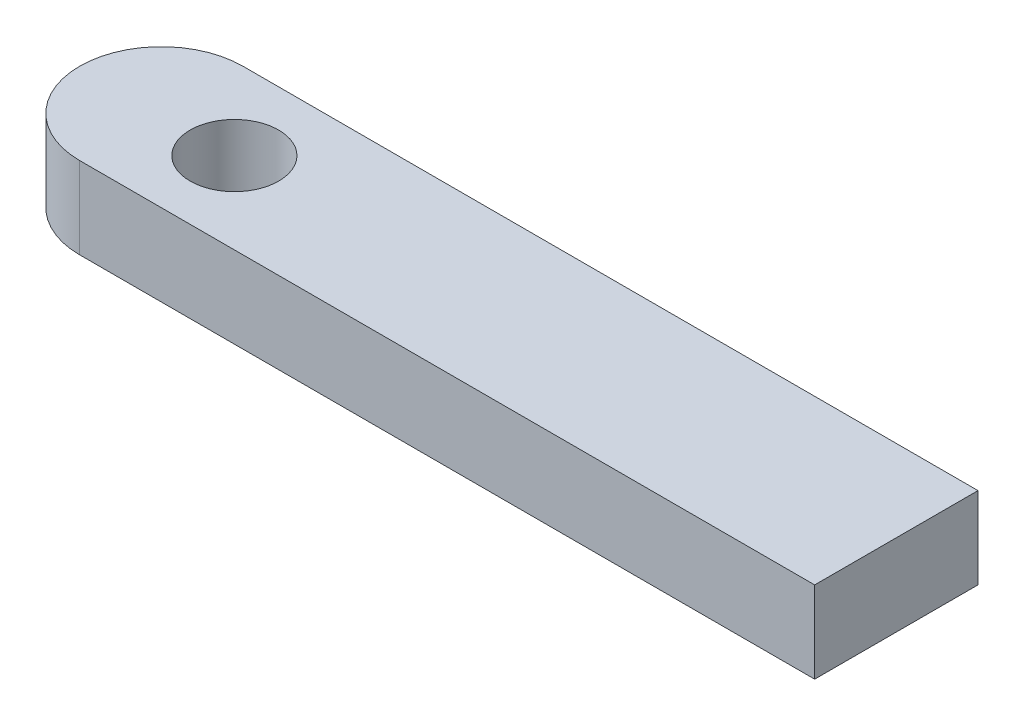
ISO-10303-21;
HEADER;
FILE_DESCRIPTION(('STEP AP214'),'2;1');
FILE_NAME('part.step','',(''),(''),'','','');
FILE_SCHEMA(('AUTOMOTIVE_DESIGN { 1 0 10303 214 1 1 1 1 }'));
ENDSEC;
DATA;
#1=APPLICATION_CONTEXT('core data for automotive mechanical design processes');
#2=APPLICATION_PROTOCOL_DEFINITION('international standard','automotive_design',2000,#1);
#3=PRODUCT_CONTEXT('',#1,'mechanical');
#4=PRODUCT('Part','Part','',(#3));
#5=PRODUCT_RELATED_PRODUCT_CATEGORY('part','',(#4));
#6=PRODUCT_DEFINITION_FORMATION('','',#4);
#7=PRODUCT_DEFINITION_CONTEXT('part definition',#1,'design');
#8=PRODUCT_DEFINITION('design','',#6,#7);
#9=PRODUCT_DEFINITION_SHAPE('','',#8);
#10=(LENGTH_UNIT() NAMED_UNIT(*) SI_UNIT(.MILLI.,.METRE.));
#11=(NAMED_UNIT(*) PLANE_ANGLE_UNIT() SI_UNIT($,.RADIAN.));
#12=(NAMED_UNIT(*) SI_UNIT($,.STERADIAN.) SOLID_ANGLE_UNIT());
#13=UNCERTAINTY_MEASURE_WITH_UNIT(LENGTH_MEASURE(1.E-05),#10,'distance_accuracy_value','');
#14=(GEOMETRIC_REPRESENTATION_CONTEXT(3) GLOBAL_UNCERTAINTY_ASSIGNED_CONTEXT((#13)) GLOBAL_UNIT_ASSIGNED_CONTEXT((#10,
#11,#12)) REPRESENTATION_CONTEXT('',''));
#15=CARTESIAN_POINT('',(0.,0.,0.));
#16=DIRECTION('',(0.,0.,1.));
#17=DIRECTION('',(1.,0.,0.));
#18=AXIS2_PLACEMENT_3D('',#15,#16,#17);
#19=CARTESIAN_POINT('',(0.,5.,0.));
#20=DIRECTION('',(0.,1.,0.));
#21=DIRECTION('',(0.,0.,1.));
#22=AXIS2_PLACEMENT_3D('',#19,#20,#21);
#23=PLANE('',#22);
#24=DIRECTION('',(-1.,0.,0.));
#25=VECTOR('',#24,1.);
#26=CARTESIAN_POINT('',(25.,5.,-5.));
#27=LINE('',#26,#25);
#28=CARTESIAN_POINT('',(25.,5.,-5.));
#29=VERTEX_POINT('',#28);
#30=CARTESIAN_POINT('',(-20.,5.,-5.));
#31=VERTEX_POINT('',#30);
#32=EDGE_CURVE('E97',#29,#31,#27,.T.);
#33=ORIENTED_EDGE('',*,*,#32,.T.);
#34=CARTESIAN_POINT('',(-20.,5.,0.));
#35=DIRECTION('',(0.,1.,0.));
#36=DIRECTION('',(0.,0.,1.));
#37=AXIS2_PLACEMENT_3D('',#34,#35,#36);
#38=CIRCLE('',#37,5.);
#39=CARTESIAN_POINT('',(-25.,5.,0.));
#40=VERTEX_POINT('',#39);
#41=EDGE_CURVE('E42',#31,#40,#38,.T.);
#42=ORIENTED_EDGE('',*,*,#41,.T.);
#43=CARTESIAN_POINT('',(-20.,5.,0.));
#44=DIRECTION('',(0.,1.,0.));
#45=DIRECTION('',(0.,0.,1.));
#46=AXIS2_PLACEMENT_3D('',#43,#44,#45);
#47=CIRCLE('',#46,5.);
#48=CARTESIAN_POINT('',(-20.,5.,5.));
#49=VERTEX_POINT('',#48);
#50=EDGE_CURVE('E49',#40,#49,#47,.T.);
#51=ORIENTED_EDGE('',*,*,#50,.T.);
#52=DIRECTION('',(1.,0.,0.));
#53=VECTOR('',#52,1.);
#54=CARTESIAN_POINT('',(25.,5.,5.));
#55=LINE('',#54,#53);
#56=CARTESIAN_POINT('',(25.,5.,5.));
#57=VERTEX_POINT('',#56);
#58=EDGE_CURVE('E74',#49,#57,#55,.T.);
#59=ORIENTED_EDGE('',*,*,#58,.T.);
#60=DIRECTION('',(0.,0.,-1.));
#61=VECTOR('',#60,1.);
#62=CARTESIAN_POINT('',(25.,5.,5.));
#63=LINE('',#62,#61);
#64=EDGE_CURVE('E78',#57,#29,#63,.T.);
#65=ORIENTED_EDGE('',*,*,#64,.T.);
#66=EDGE_LOOP('',(#33,#42,#51,#59,#65));
#67=FACE_BOUND('',#66,.T.);
#68=CARTESIAN_POINT('',(-15.5245929285736,5.,0.));
#69=DIRECTION('',(0.,1.,0.));
#70=DIRECTION('',(0.,0.,1.));
#71=AXIS2_PLACEMENT_3D('',#68,#69,#70);
#72=CIRCLE('',#71,2.70974050578997);
#73=CARTESIAN_POINT('',(-15.5245929285736,5.,2.70974050578997));
#74=VERTEX_POINT('',#73);
#75=EDGE_CURVE('E104',#74,#74,#72,.T.);
#76=ORIENTED_EDGE('',*,*,#75,.F.);
#77=EDGE_LOOP('',(#76));
#78=FACE_BOUND('',#77,.T.);
#79=ADVANCED_FACE('F33',(#67,#78),#23,.T.);
#80=CARTESIAN_POINT('',(0.,0.,0.));
#81=DIRECTION('',(0.,1.,0.));
#82=DIRECTION('',(0.,0.,1.));
#83=AXIS2_PLACEMENT_3D('',#80,#81,#82);
#84=PLANE('',#83);
#85=CARTESIAN_POINT('',(-20.,0.,0.));
#86=DIRECTION('',(0.,1.,0.));
#87=DIRECTION('',(0.,0.,1.));
#88=AXIS2_PLACEMENT_3D('',#85,#86,#87);
#89=CIRCLE('',#88,5.);
#90=CARTESIAN_POINT('',(-20.,0.,5.));
#91=VERTEX_POINT('',#90);
#92=CARTESIAN_POINT('',(-25.,0.,0.));
#93=VERTEX_POINT('',#92);
#94=EDGE_CURVE('E91',#91,#93,#89,.F.);
#95=ORIENTED_EDGE('',*,*,#94,.T.);
#96=CARTESIAN_POINT('',(-20.,0.,0.));
#97=DIRECTION('',(0.,1.,0.));
#98=DIRECTION('',(0.,0.,1.));
#99=AXIS2_PLACEMENT_3D('',#96,#97,#98);
#100=CIRCLE('',#99,5.);
#101=CARTESIAN_POINT('',(-20.,0.,-5.));
#102=VERTEX_POINT('',#101);
#103=EDGE_CURVE('E110',#93,#102,#100,.F.);
#104=ORIENTED_EDGE('',*,*,#103,.T.);
#105=DIRECTION('',(-1.,0.,0.));
#106=VECTOR('',#105,1.);
#107=CARTESIAN_POINT('',(25.,0.,-5.));
#108=LINE('',#107,#106);
#109=CARTESIAN_POINT('',(25.,0.,-5.));
#110=VERTEX_POINT('',#109);
#111=EDGE_CURVE('E82',#110,#102,#108,.T.);
#112=ORIENTED_EDGE('',*,*,#111,.F.);
#113=DIRECTION('',(0.,0.,-1.));
#114=VECTOR('',#113,1.);
#115=CARTESIAN_POINT('',(25.,0.,5.));
#116=LINE('',#115,#114);
#117=CARTESIAN_POINT('',(25.,0.,5.));
#118=VERTEX_POINT('',#117);
#119=EDGE_CURVE('E103',#118,#110,#116,.T.);
#120=ORIENTED_EDGE('',*,*,#119,.F.);
#121=DIRECTION('',(1.,0.,0.));
#122=VECTOR('',#121,1.);
#123=CARTESIAN_POINT('',(25.,0.,5.));
#124=LINE('',#123,#122);
#125=EDGE_CURVE('E88',#91,#118,#124,.T.);
#126=ORIENTED_EDGE('',*,*,#125,.F.);
#127=EDGE_LOOP('',(#95,#104,#112,#120,#126));
#128=FACE_BOUND('',#127,.T.);
#129=CARTESIAN_POINT('',(-15.5245929285736,0.,0.));
#130=DIRECTION('',(0.,1.,0.));
#131=DIRECTION('',(0.,0.,1.));
#132=AXIS2_PLACEMENT_3D('',#129,#130,#131);
#133=CIRCLE('',#132,2.70974050578997);
#134=CARTESIAN_POINT('',(-15.5245929285736,0.,2.70974050578997));
#135=VERTEX_POINT('',#134);
#136=EDGE_CURVE('E127',#135,#135,#133,.T.);
#137=ORIENTED_EDGE('',*,*,#136,.T.);
#138=EDGE_LOOP('',(#137));
#139=FACE_BOUND('',#138,.T.);
#140=ADVANCED_FACE('F138',(#128,#139),#84,.F.);
#141=CARTESIAN_POINT('',(25.,5.,5.));
#142=DIRECTION('',(0.,0.,-1.));
#143=DIRECTION('',(-1.,0.,0.));
#144=AXIS2_PLACEMENT_3D('',#141,#142,#143);
#145=PLANE('',#144);
#146=ORIENTED_EDGE('',*,*,#58,.F.);
#147=DIRECTION('',(0.,-1.,0.));
#148=VECTOR('',#147,1.);
#149=CARTESIAN_POINT('',(-20.,5.,5.));
#150=LINE('',#149,#148);
#151=EDGE_CURVE('E11',#49,#91,#150,.T.);
#152=ORIENTED_EDGE('',*,*,#151,.T.);
#153=ORIENTED_EDGE('',*,*,#125,.T.);
#154=DIRECTION('',(0.,-1.,0.));
#155=VECTOR('',#154,1.);
#156=CARTESIAN_POINT('',(25.,5.,5.));
#157=LINE('',#156,#155);
#158=EDGE_CURVE('E85',#57,#118,#157,.T.);
#159=ORIENTED_EDGE('',*,*,#158,.F.);
#160=EDGE_LOOP('',(#146,#152,#153,#159));
#161=FACE_BOUND('',#160,.T.);
#162=ADVANCED_FACE('F86',(#161),#145,.F.);
#163=CARTESIAN_POINT('',(25.,5.,5.));
#164=DIRECTION('',(-1.,0.,0.));
#165=DIRECTION('',(0.,0.,1.));
#166=AXIS2_PLACEMENT_3D('',#163,#164,#165);
#167=PLANE('',#166);
#168=ORIENTED_EDGE('',*,*,#119,.T.);
#169=DIRECTION('',(0.,-1.,0.));
#170=VECTOR('',#169,1.);
#171=CARTESIAN_POINT('',(25.,5.,-5.));
#172=LINE('',#171,#170);
#173=EDGE_CURVE('E92',#29,#110,#172,.T.);
#174=ORIENTED_EDGE('',*,*,#173,.F.);
#175=ORIENTED_EDGE('',*,*,#64,.F.);
#176=ORIENTED_EDGE('',*,*,#158,.T.);
#177=EDGE_LOOP('',(#168,#174,#175,#176));
#178=FACE_BOUND('',#177,.T.);
#179=ADVANCED_FACE('F94',(#178),#167,.F.);
#180=CARTESIAN_POINT('',(25.,5.,-5.));
#181=DIRECTION('',(0.,0.,1.));
#182=DIRECTION('',(1.,0.,0.));
#183=AXIS2_PLACEMENT_3D('',#180,#181,#182);
#184=PLANE('',#183);
#185=ORIENTED_EDGE('',*,*,#111,.T.);
#186=DIRECTION('',(0.,-1.,0.));
#187=VECTOR('',#186,1.);
#188=CARTESIAN_POINT('',(-20.,5.,-5.));
#189=LINE('',#188,#187);
#190=EDGE_CURVE('E112',#102,#31,#189,.F.);
#191=ORIENTED_EDGE('',*,*,#190,.T.);
#192=ORIENTED_EDGE('',*,*,#32,.F.);
#193=ORIENTED_EDGE('',*,*,#173,.T.);
#194=EDGE_LOOP('',(#185,#191,#192,#193));
#195=FACE_BOUND('',#194,.T.);
#196=ADVANCED_FACE('F118',(#195),#184,.F.);
#197=CARTESIAN_POINT('',(-15.5245929285736,5.,0.));
#198=DIRECTION('',(0.,-1.,0.));
#199=DIRECTION('',(0.,0.,-1.));
#200=AXIS2_PLACEMENT_3D('',#197,#198,#199);
#201=CYLINDRICAL_SURFACE('',#200,2.70974050578997);
#202=ORIENTED_EDGE('',*,*,#75,.T.);
#203=EDGE_LOOP('',(#202));
#204=FACE_BOUND('',#203,.T.);
#205=ORIENTED_EDGE('',*,*,#136,.F.);
#206=EDGE_LOOP('',(#205));
#207=FACE_BOUND('',#206,.T.);
#208=ADVANCED_FACE('F135',(#204,#207),#201,.F.);
#209=CARTESIAN_POINT('',(-20.,5.,0.));
#210=DIRECTION('',(0.,-1.,0.));
#211=DIRECTION('',(0.,0.,-1.));
#212=AXIS2_PLACEMENT_3D('',#209,#210,#211);
#213=CYLINDRICAL_SURFACE('',#212,5.);
#214=ORIENTED_EDGE('',*,*,#151,.F.);
#215=ORIENTED_EDGE('',*,*,#50,.F.);
#216=DIRECTION('',(0.,-1.,0.));
#217=VECTOR('',#216,1.);
#218=CARTESIAN_POINT('',(-25.,5.,0.));
#219=LINE('',#218,#217);
#220=EDGE_CURVE('E37',#93,#40,#219,.F.);
#221=ORIENTED_EDGE('',*,*,#220,.F.);
#222=ORIENTED_EDGE('',*,*,#94,.F.);
#223=EDGE_LOOP('',(#214,#215,#221,#222));
#224=FACE_BOUND('',#223,.T.);
#225=ADVANCED_FACE('F35',(#224),#213,.T.);
#226=CARTESIAN_POINT('',(-20.,5.,0.));
#227=DIRECTION('',(0.,-1.,0.));
#228=DIRECTION('',(0.,0.,-1.));
#229=AXIS2_PLACEMENT_3D('',#226,#227,#228);
#230=CYLINDRICAL_SURFACE('',#229,5.);
#231=ORIENTED_EDGE('',*,*,#41,.F.);
#232=ORIENTED_EDGE('',*,*,#190,.F.);
#233=ORIENTED_EDGE('',*,*,#103,.F.);
#234=ORIENTED_EDGE('',*,*,#220,.T.);
#235=EDGE_LOOP('',(#231,#232,#233,#234));
#236=FACE_BOUND('',#235,.T.);
#237=ADVANCED_FACE('F122',(#236),#230,.T.);
#238=CLOSED_SHELL('',(#79,#140,#162,#179,#196,#208,#225,#237));
#239=MANIFOLD_SOLID_BREP('B2',#238);
#240=ADVANCED_BREP_SHAPE_REPRESENTATION('',(#18,#239),#14);
#241=SHAPE_DEFINITION_REPRESENTATION(#9,#240);
ENDSEC;
END-ISO-10303-21;
